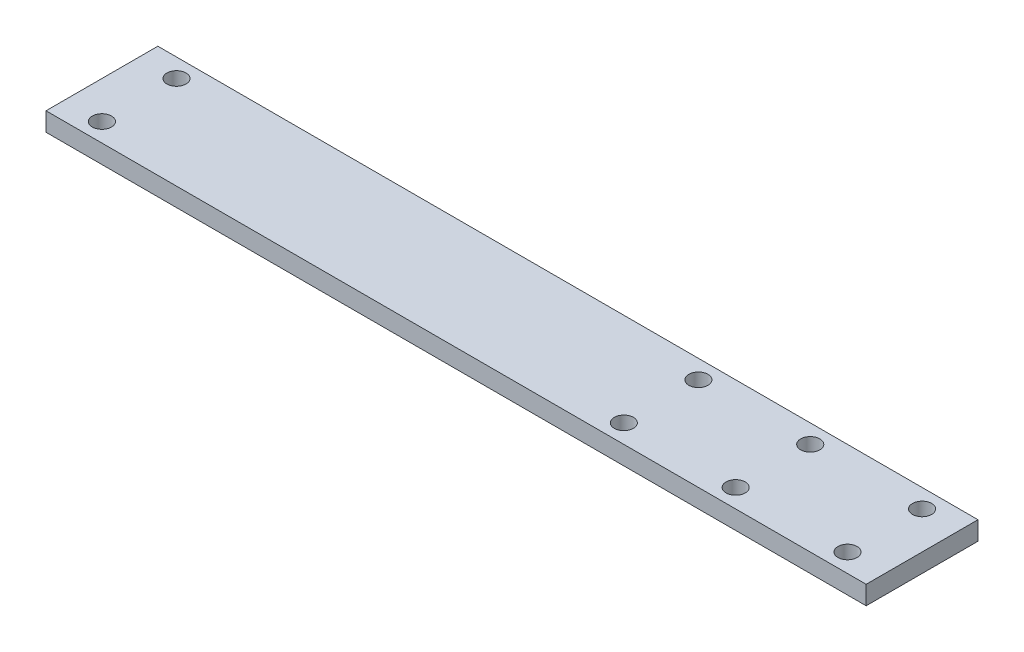
ISO-10303-21;
HEADER;
FILE_DESCRIPTION(('STEP AP214'),'2;1');
FILE_NAME('part.step','',(''),(''),'','','');
FILE_SCHEMA(('AUTOMOTIVE_DESIGN { 1 0 10303 214 1 1 1 1 }'));
ENDSEC;
DATA;
#1=APPLICATION_CONTEXT('core data for automotive mechanical design processes');
#2=APPLICATION_PROTOCOL_DEFINITION('international standard','automotive_design',2000,#1);
#3=PRODUCT_CONTEXT('',#1,'mechanical');
#4=PRODUCT('Part','Part','',(#3));
#5=PRODUCT_RELATED_PRODUCT_CATEGORY('part','',(#4));
#6=PRODUCT_DEFINITION_FORMATION('','',#4);
#7=PRODUCT_DEFINITION_CONTEXT('part definition',#1,'design');
#8=PRODUCT_DEFINITION('design','',#6,#7);
#9=PRODUCT_DEFINITION_SHAPE('','',#8);
#10=(LENGTH_UNIT() NAMED_UNIT(*) SI_UNIT(.MILLI.,.METRE.));
#11=(NAMED_UNIT(*) PLANE_ANGLE_UNIT() SI_UNIT($,.RADIAN.));
#12=(NAMED_UNIT(*) SI_UNIT($,.STERADIAN.) SOLID_ANGLE_UNIT());
#13=UNCERTAINTY_MEASURE_WITH_UNIT(LENGTH_MEASURE(1.E-05),#10,'distance_accuracy_value','');
#14=(GEOMETRIC_REPRESENTATION_CONTEXT(3) GLOBAL_UNCERTAINTY_ASSIGNED_CONTEXT((#13)) GLOBAL_UNIT_ASSIGNED_CONTEXT((#10,
#11,#12)) REPRESENTATION_CONTEXT('',''));
#15=CARTESIAN_POINT('',(0.,0.,0.));
#16=DIRECTION('',(0.,0.,1.));
#17=DIRECTION('',(1.,0.,0.));
#18=AXIS2_PLACEMENT_3D('',#15,#16,#17);
#19=CARTESIAN_POINT('',(139.7,6.35,-19.05));
#20=DIRECTION('',(-1.,0.,0.));
#21=DIRECTION('',(0.,0.,1.));
#22=AXIS2_PLACEMENT_3D('',#19,#20,#21);
#23=PLANE('',#22);
#24=DIRECTION('',(0.,0.,-1.));
#25=VECTOR('',#24,1.);
#26=CARTESIAN_POINT('',(139.7,0.,-19.05));
#27=LINE('',#26,#25);
#28=CARTESIAN_POINT('',(139.7,0.,19.05));
#29=VERTEX_POINT('',#28);
#30=CARTESIAN_POINT('',(139.7,0.,-19.05));
#31=VERTEX_POINT('',#30);
#32=EDGE_CURVE('E94',#29,#31,#27,.T.);
#33=ORIENTED_EDGE('',*,*,#32,.T.);
#34=DIRECTION('',(0.,-1.,0.));
#35=VECTOR('',#34,1.);
#36=CARTESIAN_POINT('',(139.7,6.35,-19.05));
#37=LINE('',#36,#35);
#38=CARTESIAN_POINT('',(139.7,6.35,-19.05));
#39=VERTEX_POINT('',#38);
#40=EDGE_CURVE('E11',#39,#31,#37,.T.);
#41=ORIENTED_EDGE('',*,*,#40,.F.);
#42=DIRECTION('',(0.,0.,-1.));
#43=VECTOR('',#42,1.);
#44=CARTESIAN_POINT('',(139.7,6.35,-19.05));
#45=LINE('',#44,#43);
#46=CARTESIAN_POINT('',(139.7,6.35,19.05));
#47=VERTEX_POINT('',#46);
#48=EDGE_CURVE('E82',#47,#39,#45,.T.);
#49=ORIENTED_EDGE('',*,*,#48,.F.);
#50=DIRECTION('',(0.,-1.,0.));
#51=VECTOR('',#50,1.);
#52=CARTESIAN_POINT('',(139.7,6.35,19.05));
#53=LINE('',#52,#51);
#54=EDGE_CURVE('E90',#47,#29,#53,.T.);
#55=ORIENTED_EDGE('',*,*,#54,.T.);
#56=EDGE_LOOP('',(#33,#41,#49,#55));
#57=FACE_BOUND('',#56,.T.);
#58=ADVANCED_FACE('F31',(#57),#23,.F.);
#59=CARTESIAN_POINT('',(-139.7,6.35,-19.05));
#60=DIRECTION('',(0.,0.,1.));
#61=DIRECTION('',(1.,0.,0.));
#62=AXIS2_PLACEMENT_3D('',#59,#60,#61);
#63=PLANE('',#62);
#64=DIRECTION('',(-1.,0.,0.));
#65=VECTOR('',#64,1.);
#66=CARTESIAN_POINT('',(-139.7,0.,-19.05));
#67=LINE('',#66,#65);
#68=CARTESIAN_POINT('',(-139.7,0.,-19.05));
#69=VERTEX_POINT('',#68);
#70=EDGE_CURVE('E86',#31,#69,#67,.T.);
#71=ORIENTED_EDGE('',*,*,#70,.T.);
#72=DIRECTION('',(0.,-1.,0.));
#73=VECTOR('',#72,1.);
#74=CARTESIAN_POINT('',(-139.7,6.35,-19.05));
#75=LINE('',#74,#73);
#76=CARTESIAN_POINT('',(-139.7,6.35,-19.05));
#77=VERTEX_POINT('',#76);
#78=EDGE_CURVE('E39',#77,#69,#75,.T.);
#79=ORIENTED_EDGE('',*,*,#78,.F.);
#80=DIRECTION('',(-1.,0.,0.));
#81=VECTOR('',#80,1.);
#82=CARTESIAN_POINT('',(-139.7,6.35,-19.05));
#83=LINE('',#82,#81);
#84=EDGE_CURVE('E77',#39,#77,#83,.T.);
#85=ORIENTED_EDGE('',*,*,#84,.F.);
#86=ORIENTED_EDGE('',*,*,#40,.T.);
#87=EDGE_LOOP('',(#71,#79,#85,#86));
#88=FACE_BOUND('',#87,.T.);
#89=ADVANCED_FACE('F85',(#88),#63,.F.);
#90=CARTESIAN_POINT('',(-139.7,6.35,-19.05));
#91=DIRECTION('',(1.,0.,0.));
#92=DIRECTION('',(0.,0.,-1.));
#93=AXIS2_PLACEMENT_3D('',#90,#91,#92);
#94=PLANE('',#93);
#95=DIRECTION('',(0.,0.,1.));
#96=VECTOR('',#95,1.);
#97=CARTESIAN_POINT('',(-139.7,0.,-19.05));
#98=LINE('',#97,#96);
#99=CARTESIAN_POINT('',(-139.7,0.,19.05));
#100=VERTEX_POINT('',#99);
#101=EDGE_CURVE('E64',#69,#100,#98,.T.);
#102=ORIENTED_EDGE('',*,*,#101,.T.);
#103=DIRECTION('',(0.,-1.,0.));
#104=VECTOR('',#103,1.);
#105=CARTESIAN_POINT('',(-139.7,6.35,19.05));
#106=LINE('',#105,#104);
#107=CARTESIAN_POINT('',(-139.7,6.35,19.05));
#108=VERTEX_POINT('',#107);
#109=EDGE_CURVE('E87',#108,#100,#106,.T.);
#110=ORIENTED_EDGE('',*,*,#109,.F.);
#111=DIRECTION('',(0.,0.,1.));
#112=VECTOR('',#111,1.);
#113=CARTESIAN_POINT('',(-139.7,6.35,-19.05));
#114=LINE('',#113,#112);
#115=EDGE_CURVE('E80',#77,#108,#114,.T.);
#116=ORIENTED_EDGE('',*,*,#115,.F.);
#117=ORIENTED_EDGE('',*,*,#78,.T.);
#118=EDGE_LOOP('',(#102,#110,#116,#117));
#119=FACE_BOUND('',#118,.T.);
#120=ADVANCED_FACE('F88',(#119),#94,.F.);
#121=CARTESIAN_POINT('',(-139.7,6.35,19.05));
#122=DIRECTION('',(0.,0.,-1.));
#123=DIRECTION('',(-1.,0.,0.));
#124=AXIS2_PLACEMENT_3D('',#121,#122,#123);
#125=PLANE('',#124);
#126=DIRECTION('',(1.,0.,0.));
#127=VECTOR('',#126,1.);
#128=CARTESIAN_POINT('',(-139.7,0.,19.05));
#129=LINE('',#128,#127);
#130=EDGE_CURVE('E70',#100,#29,#129,.T.);
#131=ORIENTED_EDGE('',*,*,#130,.T.);
#132=ORIENTED_EDGE('',*,*,#54,.F.);
#133=DIRECTION('',(1.,0.,0.));
#134=VECTOR('',#133,1.);
#135=CARTESIAN_POINT('',(-139.7,6.35,19.05));
#136=LINE('',#135,#134);
#137=EDGE_CURVE('E47',#108,#47,#136,.T.);
#138=ORIENTED_EDGE('',*,*,#137,.F.);
#139=ORIENTED_EDGE('',*,*,#109,.T.);
#140=EDGE_LOOP('',(#131,#132,#138,#139));
#141=FACE_BOUND('',#140,.T.);
#142=ADVANCED_FACE('F102',(#141),#125,.F.);
#143=CARTESIAN_POINT('',(139.7,6.35,19.05));
#144=DIRECTION('',(0.,1.,0.));
#145=DIRECTION('',(0.,0.,1.));
#146=AXIS2_PLACEMENT_3D('',#143,#144,#145);
#147=PLANE('',#146);
#148=CARTESIAN_POINT('',(-127.,6.35,12.7));
#149=DIRECTION('',(0.,1.,0.));
#150=DIRECTION('',(0.,0.,1.));
#151=AXIS2_PLACEMENT_3D('',#148,#149,#150);
#152=CIRCLE('',#151,3.26389999999999);
#153=CARTESIAN_POINT('',(-127.,6.35,15.9639));
#154=VERTEX_POINT('',#153);
#155=EDGE_CURVE('E152',#154,#154,#152,.T.);
#156=ORIENTED_EDGE('',*,*,#155,.F.);
#157=EDGE_LOOP('',(#156));
#158=FACE_BOUND('',#157,.T.);
#159=CARTESIAN_POINT('',(-127.,6.35,-12.7));
#160=DIRECTION('',(0.,1.,0.));
#161=DIRECTION('',(0.,0.,1.));
#162=AXIS2_PLACEMENT_3D('',#159,#160,#161);
#163=CIRCLE('',#162,3.26389999999999);
#164=CARTESIAN_POINT('',(-127.,6.35,-9.43610000000001));
#165=VERTEX_POINT('',#164);
#166=EDGE_CURVE('E146',#165,#165,#163,.T.);
#167=ORIENTED_EDGE('',*,*,#166,.F.);
#168=EDGE_LOOP('',(#167));
#169=FACE_BOUND('',#168,.T.);
#170=CARTESIAN_POINT('',(127.,6.35,-12.7));
#171=DIRECTION('',(0.,1.,0.));
#172=DIRECTION('',(0.,0.,1.));
#173=AXIS2_PLACEMENT_3D('',#170,#171,#172);
#174=CIRCLE('',#173,3.26389999999999);
#175=CARTESIAN_POINT('',(127.,6.35,-9.43610000000004));
#176=VERTEX_POINT('',#175);
#177=EDGE_CURVE('E140',#176,#176,#174,.T.);
#178=ORIENTED_EDGE('',*,*,#177,.F.);
#179=EDGE_LOOP('',(#178));
#180=FACE_BOUND('',#179,.T.);
#181=CARTESIAN_POINT('',(127.,6.35,12.7));
#182=DIRECTION('',(0.,1.,0.));
#183=DIRECTION('',(0.,0.,1.));
#184=AXIS2_PLACEMENT_3D('',#181,#182,#183);
#185=CIRCLE('',#184,3.26389999999999);
#186=CARTESIAN_POINT('',(127.,6.35,15.9639));
#187=VERTEX_POINT('',#186);
#188=EDGE_CURVE('E134',#187,#187,#185,.T.);
#189=ORIENTED_EDGE('',*,*,#188,.F.);
#190=EDGE_LOOP('',(#189));
#191=FACE_BOUND('',#190,.T.);
#192=CARTESIAN_POINT('',(88.9,6.35,-12.7));
#193=DIRECTION('',(0.,1.,0.));
#194=DIRECTION('',(0.,0.,1.));
#195=AXIS2_PLACEMENT_3D('',#192,#193,#194);
#196=CIRCLE('',#195,3.26389999999999);
#197=CARTESIAN_POINT('',(88.9,6.35,-9.43610000000004));
#198=VERTEX_POINT('',#197);
#199=EDGE_CURVE('E128',#198,#198,#196,.T.);
#200=ORIENTED_EDGE('',*,*,#199,.F.);
#201=EDGE_LOOP('',(#200));
#202=FACE_BOUND('',#201,.T.);
#203=CARTESIAN_POINT('',(88.9,6.35,12.7));
#204=DIRECTION('',(0.,1.,0.));
#205=DIRECTION('',(0.,0.,1.));
#206=AXIS2_PLACEMENT_3D('',#203,#204,#205);
#207=CIRCLE('',#206,3.26389999999999);
#208=CARTESIAN_POINT('',(88.9,6.35,15.9639));
#209=VERTEX_POINT('',#208);
#210=EDGE_CURVE('E122',#209,#209,#207,.T.);
#211=ORIENTED_EDGE('',*,*,#210,.F.);
#212=EDGE_LOOP('',(#211));
#213=FACE_BOUND('',#212,.T.);
#214=CARTESIAN_POINT('',(50.8,6.35,-12.7));
#215=DIRECTION('',(0.,1.,0.));
#216=DIRECTION('',(0.,0.,1.));
#217=AXIS2_PLACEMENT_3D('',#214,#215,#216);
#218=CIRCLE('',#217,3.26389999999999);
#219=CARTESIAN_POINT('',(50.8,6.35,-9.43610000000003));
#220=VERTEX_POINT('',#219);
#221=EDGE_CURVE('E116',#220,#220,#218,.T.);
#222=ORIENTED_EDGE('',*,*,#221,.F.);
#223=EDGE_LOOP('',(#222));
#224=FACE_BOUND('',#223,.T.);
#225=CARTESIAN_POINT('',(50.8,6.35,12.7));
#226=DIRECTION('',(0.,1.,0.));
#227=DIRECTION('',(0.,0.,1.));
#228=AXIS2_PLACEMENT_3D('',#225,#226,#227);
#229=CIRCLE('',#228,3.26389999999999);
#230=CARTESIAN_POINT('',(50.8,6.35,15.9639));
#231=VERTEX_POINT('',#230);
#232=EDGE_CURVE('E110',#231,#231,#229,.T.);
#233=ORIENTED_EDGE('',*,*,#232,.F.);
#234=EDGE_LOOP('',(#233));
#235=FACE_BOUND('',#234,.T.);
#236=ORIENTED_EDGE('',*,*,#48,.T.);
#237=ORIENTED_EDGE('',*,*,#84,.T.);
#238=ORIENTED_EDGE('',*,*,#115,.T.);
#239=ORIENTED_EDGE('',*,*,#137,.T.);
#240=EDGE_LOOP('',(#236,#237,#238,#239));
#241=FACE_BOUND('',#240,.T.);
#242=ADVANCED_FACE('F78',(#158,#169,#180,#191,#202,#213,#224,#235,#241),#147,.T.);
#243=CARTESIAN_POINT('',(139.7,0.,19.05));
#244=DIRECTION('',(0.,1.,0.));
#245=DIRECTION('',(0.,0.,1.));
#246=AXIS2_PLACEMENT_3D('',#243,#244,#245);
#247=PLANE('',#246);
#248=CARTESIAN_POINT('',(-127.,0.,12.7));
#249=DIRECTION('',(0.,1.,0.));
#250=DIRECTION('',(0.,0.,1.));
#251=AXIS2_PLACEMENT_3D('',#248,#249,#250);
#252=CIRCLE('',#251,3.26389999999999);
#253=CARTESIAN_POINT('',(-127.,0.,15.9639));
#254=VERTEX_POINT('',#253);
#255=EDGE_CURVE('E149',#254,#254,#252,.T.);
#256=ORIENTED_EDGE('',*,*,#255,.T.);
#257=EDGE_LOOP('',(#256));
#258=FACE_BOUND('',#257,.T.);
#259=CARTESIAN_POINT('',(-127.,0.,-12.7));
#260=DIRECTION('',(0.,1.,0.));
#261=DIRECTION('',(0.,0.,1.));
#262=AXIS2_PLACEMENT_3D('',#259,#260,#261);
#263=CIRCLE('',#262,3.26389999999999);
#264=CARTESIAN_POINT('',(-127.,0.,-9.43610000000001));
#265=VERTEX_POINT('',#264);
#266=EDGE_CURVE('E143',#265,#265,#263,.T.);
#267=ORIENTED_EDGE('',*,*,#266,.T.);
#268=EDGE_LOOP('',(#267));
#269=FACE_BOUND('',#268,.T.);
#270=CARTESIAN_POINT('',(127.,0.,-12.7));
#271=DIRECTION('',(0.,1.,0.));
#272=DIRECTION('',(0.,0.,1.));
#273=AXIS2_PLACEMENT_3D('',#270,#271,#272);
#274=CIRCLE('',#273,3.26389999999999);
#275=CARTESIAN_POINT('',(127.,0.,-9.43610000000004));
#276=VERTEX_POINT('',#275);
#277=EDGE_CURVE('E137',#276,#276,#274,.T.);
#278=ORIENTED_EDGE('',*,*,#277,.T.);
#279=EDGE_LOOP('',(#278));
#280=FACE_BOUND('',#279,.T.);
#281=CARTESIAN_POINT('',(127.,0.,12.7));
#282=DIRECTION('',(0.,1.,0.));
#283=DIRECTION('',(0.,0.,1.));
#284=AXIS2_PLACEMENT_3D('',#281,#282,#283);
#285=CIRCLE('',#284,3.26389999999999);
#286=CARTESIAN_POINT('',(127.,0.,15.9639));
#287=VERTEX_POINT('',#286);
#288=EDGE_CURVE('E131',#287,#287,#285,.T.);
#289=ORIENTED_EDGE('',*,*,#288,.T.);
#290=EDGE_LOOP('',(#289));
#291=FACE_BOUND('',#290,.T.);
#292=CARTESIAN_POINT('',(88.9,0.,-12.7));
#293=DIRECTION('',(0.,1.,0.));
#294=DIRECTION('',(0.,0.,1.));
#295=AXIS2_PLACEMENT_3D('',#292,#293,#294);
#296=CIRCLE('',#295,3.26389999999999);
#297=CARTESIAN_POINT('',(88.9,0.,-9.43610000000003));
#298=VERTEX_POINT('',#297);
#299=EDGE_CURVE('E125',#298,#298,#296,.T.);
#300=ORIENTED_EDGE('',*,*,#299,.T.);
#301=EDGE_LOOP('',(#300));
#302=FACE_BOUND('',#301,.T.);
#303=CARTESIAN_POINT('',(88.9,0.,12.7));
#304=DIRECTION('',(0.,1.,0.));
#305=DIRECTION('',(0.,0.,1.));
#306=AXIS2_PLACEMENT_3D('',#303,#304,#305);
#307=CIRCLE('',#306,3.26389999999999);
#308=CARTESIAN_POINT('',(88.9,0.,15.9639));
#309=VERTEX_POINT('',#308);
#310=EDGE_CURVE('E119',#309,#309,#307,.T.);
#311=ORIENTED_EDGE('',*,*,#310,.T.);
#312=EDGE_LOOP('',(#311));
#313=FACE_BOUND('',#312,.T.);
#314=CARTESIAN_POINT('',(50.8,0.,-12.7));
#315=DIRECTION('',(0.,1.,0.));
#316=DIRECTION('',(0.,0.,1.));
#317=AXIS2_PLACEMENT_3D('',#314,#315,#316);
#318=CIRCLE('',#317,3.26389999999999);
#319=CARTESIAN_POINT('',(50.8,0.,-9.43610000000003));
#320=VERTEX_POINT('',#319);
#321=EDGE_CURVE('E113',#320,#320,#318,.T.);
#322=ORIENTED_EDGE('',*,*,#321,.T.);
#323=EDGE_LOOP('',(#322));
#324=FACE_BOUND('',#323,.T.);
#325=CARTESIAN_POINT('',(50.8,0.,12.7));
#326=DIRECTION('',(0.,1.,0.));
#327=DIRECTION('',(0.,0.,1.));
#328=AXIS2_PLACEMENT_3D('',#325,#326,#327);
#329=CIRCLE('',#328,3.26389999999999);
#330=CARTESIAN_POINT('',(50.8,0.,15.9639));
#331=VERTEX_POINT('',#330);
#332=EDGE_CURVE('E97',#331,#331,#329,.T.);
#333=ORIENTED_EDGE('',*,*,#332,.T.);
#334=EDGE_LOOP('',(#333));
#335=FACE_BOUND('',#334,.T.);
#336=ORIENTED_EDGE('',*,*,#32,.F.);
#337=ORIENTED_EDGE('',*,*,#130,.F.);
#338=ORIENTED_EDGE('',*,*,#101,.F.);
#339=ORIENTED_EDGE('',*,*,#70,.F.);
#340=EDGE_LOOP('',(#336,#337,#338,#339));
#341=FACE_BOUND('',#340,.T.);
#342=ADVANCED_FACE('F105',(#258,#269,#280,#291,#302,#313,#324,#335,#341),#247,.F.);
#343=CARTESIAN_POINT('',(50.8,6.35,12.7));
#344=DIRECTION('',(0.,1.,0.));
#345=DIRECTION('',(0.,0.,1.));
#346=AXIS2_PLACEMENT_3D('',#343,#344,#345);
#347=CYLINDRICAL_SURFACE('',#346,3.26389999999999);
#348=ORIENTED_EDGE('',*,*,#332,.F.);
#349=EDGE_LOOP('',(#348));
#350=FACE_BOUND('',#349,.T.);
#351=ORIENTED_EDGE('',*,*,#232,.T.);
#352=EDGE_LOOP('',(#351));
#353=FACE_BOUND('',#352,.T.);
#354=ADVANCED_FACE('F175',(#350,#353),#347,.F.);
#355=CARTESIAN_POINT('',(50.8,6.35,-12.7));
#356=DIRECTION('',(0.,1.,0.));
#357=DIRECTION('',(0.,0.,1.));
#358=AXIS2_PLACEMENT_3D('',#355,#356,#357);
#359=CYLINDRICAL_SURFACE('',#358,3.26389999999999);
#360=ORIENTED_EDGE('',*,*,#321,.F.);
#361=EDGE_LOOP('',(#360));
#362=FACE_BOUND('',#361,.T.);
#363=ORIENTED_EDGE('',*,*,#221,.T.);
#364=EDGE_LOOP('',(#363));
#365=FACE_BOUND('',#364,.T.);
#366=ADVANCED_FACE('F177',(#362,#365),#359,.F.);
#367=CARTESIAN_POINT('',(88.9,6.35,12.7));
#368=DIRECTION('',(0.,1.,0.));
#369=DIRECTION('',(0.,0.,1.));
#370=AXIS2_PLACEMENT_3D('',#367,#368,#369);
#371=CYLINDRICAL_SURFACE('',#370,3.26389999999999);
#372=ORIENTED_EDGE('',*,*,#310,.F.);
#373=EDGE_LOOP('',(#372));
#374=FACE_BOUND('',#373,.T.);
#375=ORIENTED_EDGE('',*,*,#210,.T.);
#376=EDGE_LOOP('',(#375));
#377=FACE_BOUND('',#376,.T.);
#378=ADVANCED_FACE('F184',(#374,#377),#371,.F.);
#379=CARTESIAN_POINT('',(88.9,6.35,-12.7));
#380=DIRECTION('',(0.,1.,0.));
#381=DIRECTION('',(0.,0.,1.));
#382=AXIS2_PLACEMENT_3D('',#379,#380,#381);
#383=CYLINDRICAL_SURFACE('',#382,3.26389999999999);
#384=ORIENTED_EDGE('',*,*,#299,.F.);
#385=EDGE_LOOP('',(#384));
#386=FACE_BOUND('',#385,.T.);
#387=ORIENTED_EDGE('',*,*,#199,.T.);
#388=EDGE_LOOP('',(#387));
#389=FACE_BOUND('',#388,.T.);
#390=ADVANCED_FACE('F231',(#386,#389),#383,.F.);
#391=CARTESIAN_POINT('',(127.,6.35,12.7));
#392=DIRECTION('',(0.,1.,0.));
#393=DIRECTION('',(0.,0.,1.));
#394=AXIS2_PLACEMENT_3D('',#391,#392,#393);
#395=CYLINDRICAL_SURFACE('',#394,3.26389999999999);
#396=ORIENTED_EDGE('',*,*,#288,.F.);
#397=EDGE_LOOP('',(#396));
#398=FACE_BOUND('',#397,.T.);
#399=ORIENTED_EDGE('',*,*,#188,.T.);
#400=EDGE_LOOP('',(#399));
#401=FACE_BOUND('',#400,.T.);
#402=ADVANCED_FACE('F241',(#398,#401),#395,.F.);
#403=CARTESIAN_POINT('',(127.,6.35,-12.7));
#404=DIRECTION('',(0.,1.,0.));
#405=DIRECTION('',(0.,0.,1.));
#406=AXIS2_PLACEMENT_3D('',#403,#404,#405);
#407=CYLINDRICAL_SURFACE('',#406,3.26389999999999);
#408=ORIENTED_EDGE('',*,*,#277,.F.);
#409=EDGE_LOOP('',(#408));
#410=FACE_BOUND('',#409,.T.);
#411=ORIENTED_EDGE('',*,*,#177,.T.);
#412=EDGE_LOOP('',(#411));
#413=FACE_BOUND('',#412,.T.);
#414=ADVANCED_FACE('F251',(#410,#413),#407,.F.);
#415=CARTESIAN_POINT('',(-127.,6.35,-12.7));
#416=DIRECTION('',(0.,1.,0.));
#417=DIRECTION('',(0.,0.,1.));
#418=AXIS2_PLACEMENT_3D('',#415,#416,#417);
#419=CYLINDRICAL_SURFACE('',#418,3.26389999999999);
#420=ORIENTED_EDGE('',*,*,#266,.F.);
#421=EDGE_LOOP('',(#420));
#422=FACE_BOUND('',#421,.T.);
#423=ORIENTED_EDGE('',*,*,#166,.T.);
#424=EDGE_LOOP('',(#423));
#425=FACE_BOUND('',#424,.T.);
#426=ADVANCED_FACE('F261',(#422,#425),#419,.F.);
#427=CARTESIAN_POINT('',(-127.,6.35,12.7));
#428=DIRECTION('',(0.,1.,0.));
#429=DIRECTION('',(0.,0.,1.));
#430=AXIS2_PLACEMENT_3D('',#427,#428,#429);
#431=CYLINDRICAL_SURFACE('',#430,3.26389999999999);
#432=ORIENTED_EDGE('',*,*,#255,.F.);
#433=EDGE_LOOP('',(#432));
#434=FACE_BOUND('',#433,.T.);
#435=ORIENTED_EDGE('',*,*,#155,.T.);
#436=EDGE_LOOP('',(#435));
#437=FACE_BOUND('',#436,.T.);
#438=ADVANCED_FACE('F156',(#434,#437),#431,.F.);
#439=CLOSED_SHELL('',(#58,#89,#120,#142,#242,#342,#354,#366,#378,#390,#402,#414,#426,#438));
#440=MANIFOLD_SOLID_BREP('B2',#439);
#441=ADVANCED_BREP_SHAPE_REPRESENTATION('',(#18,#440),#14);
#442=SHAPE_DEFINITION_REPRESENTATION(#9,#441);
ENDSEC;
END-ISO-10303-21;
